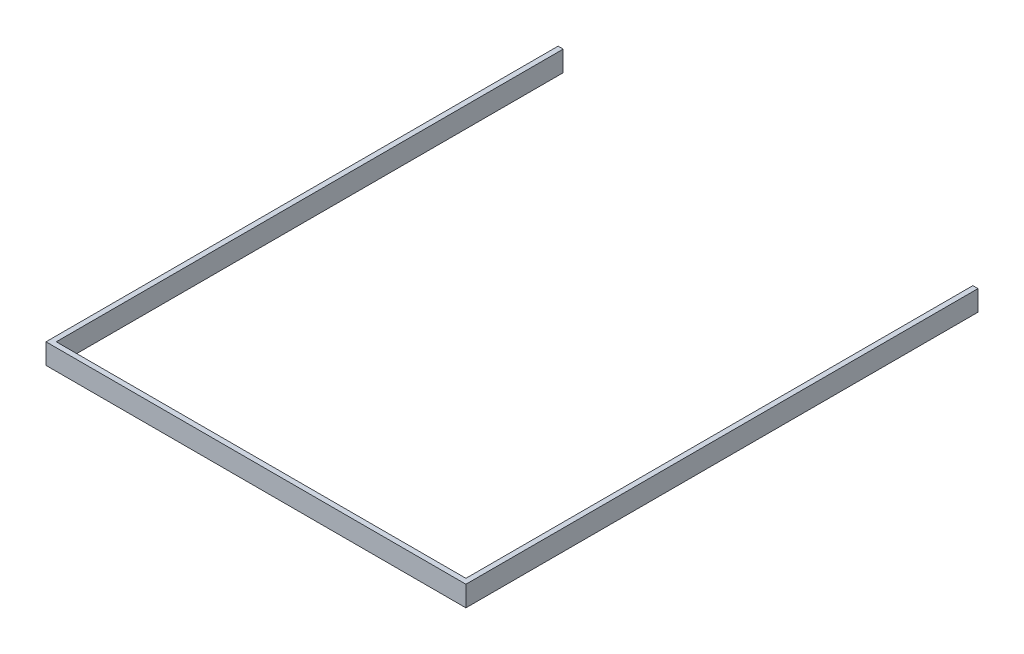
ISO-10303-21;
HEADER;
FILE_DESCRIPTION(('STEP AP214'),'2;1');
FILE_NAME('part.step','',(''),(''),'','','');
FILE_SCHEMA(('AUTOMOTIVE_DESIGN { 1 0 10303 214 1 1 1 1 }'));
ENDSEC;
DATA;
#1=APPLICATION_CONTEXT('core data for automotive mechanical design processes');
#2=APPLICATION_PROTOCOL_DEFINITION('international standard','automotive_design',2000,#1);
#3=PRODUCT_CONTEXT('',#1,'mechanical');
#4=PRODUCT('Part','Part','',(#3));
#5=PRODUCT_RELATED_PRODUCT_CATEGORY('part','',(#4));
#6=PRODUCT_DEFINITION_FORMATION('','',#4);
#7=PRODUCT_DEFINITION_CONTEXT('part definition',#1,'design');
#8=PRODUCT_DEFINITION('design','',#6,#7);
#9=PRODUCT_DEFINITION_SHAPE('','',#8);
#10=(LENGTH_UNIT() NAMED_UNIT(*) SI_UNIT(.MILLI.,.METRE.));
#11=(NAMED_UNIT(*) PLANE_ANGLE_UNIT() SI_UNIT($,.RADIAN.));
#12=(NAMED_UNIT(*) SI_UNIT($,.STERADIAN.) SOLID_ANGLE_UNIT());
#13=UNCERTAINTY_MEASURE_WITH_UNIT(LENGTH_MEASURE(1.E-05),#10,'distance_accuracy_value','');
#14=(GEOMETRIC_REPRESENTATION_CONTEXT(3) GLOBAL_UNCERTAINTY_ASSIGNED_CONTEXT((#13)) GLOBAL_UNIT_ASSIGNED_CONTEXT((#10,
#11,#12)) REPRESENTATION_CONTEXT('',''));
#15=CARTESIAN_POINT('',(0.,0.,0.));
#16=DIRECTION('',(0.,0.,1.));
#17=DIRECTION('',(1.,0.,0.));
#18=AXIS2_PLACEMENT_3D('',#15,#16,#17);
#19=CARTESIAN_POINT('',(0.,-8.,200.));
#20=DIRECTION('',(0.,1.,0.));
#21=DIRECTION('',(0.,0.,1.));
#22=AXIS2_PLACEMENT_3D('',#19,#20,#21);
#23=PLANE('',#22);
#24=DIRECTION('',(0.,0.,-1.));
#25=VECTOR('',#24,1.);
#26=CARTESIAN_POINT('',(2.,-8.,198.));
#27=LINE('',#26,#25);
#28=CARTESIAN_POINT('',(2.,-8.,198.));
#29=VERTEX_POINT('',#28);
#30=CARTESIAN_POINT('',(2.,-8.,0.));
#31=VERTEX_POINT('',#30);
#32=EDGE_CURVE('E124',#29,#31,#27,.T.);
#33=ORIENTED_EDGE('',*,*,#32,.F.);
#34=DIRECTION('',(1.,0.,0.));
#35=VECTOR('',#34,1.);
#36=CARTESIAN_POINT('',(2.,-8.,198.));
#37=LINE('',#36,#35);
#38=CARTESIAN_POINT('',(162.,-8.,198.));
#39=VERTEX_POINT('',#38);
#40=EDGE_CURVE('E112',#29,#39,#37,.T.);
#41=ORIENTED_EDGE('',*,*,#40,.T.);
#42=DIRECTION('',(0.,0.,-1.));
#43=VECTOR('',#42,1.);
#44=CARTESIAN_POINT('',(162.,-8.,198.));
#45=LINE('',#44,#43);
#46=CARTESIAN_POINT('',(162.,-8.,0.));
#47=VERTEX_POINT('',#46);
#48=EDGE_CURVE('E132',#39,#47,#45,.T.);
#49=ORIENTED_EDGE('',*,*,#48,.T.);
#50=DIRECTION('',(1.,0.,0.));
#51=VECTOR('',#50,1.);
#52=CARTESIAN_POINT('',(0.,-8.,0.));
#53=LINE('',#52,#51);
#54=CARTESIAN_POINT('',(164.,-8.,0.));
#55=VERTEX_POINT('',#54);
#56=EDGE_CURVE('E135',#47,#55,#53,.T.);
#57=ORIENTED_EDGE('',*,*,#56,.T.);
#58=DIRECTION('',(0.,0.,-1.));
#59=VECTOR('',#58,1.);
#60=CARTESIAN_POINT('',(164.,-8.,200.));
#61=LINE('',#60,#59);
#62=CARTESIAN_POINT('',(164.,-8.,200.));
#63=VERTEX_POINT('',#62);
#64=EDGE_CURVE('E45',#63,#55,#61,.T.);
#65=ORIENTED_EDGE('',*,*,#64,.F.);
#66=DIRECTION('',(1.,0.,0.));
#67=VECTOR('',#66,1.);
#68=CARTESIAN_POINT('',(0.,-8.,200.));
#69=LINE('',#68,#67);
#70=CARTESIAN_POINT('',(0.,-8.,200.));
#71=VERTEX_POINT('',#70);
#72=EDGE_CURVE('E89',#71,#63,#69,.T.);
#73=ORIENTED_EDGE('',*,*,#72,.F.);
#74=DIRECTION('',(0.,0.,-1.));
#75=VECTOR('',#74,1.);
#76=CARTESIAN_POINT('',(0.,-8.,200.));
#77=LINE('',#76,#75);
#78=CARTESIAN_POINT('',(0.,-8.,0.));
#79=VERTEX_POINT('',#78);
#80=EDGE_CURVE('E11',#71,#79,#77,.T.);
#81=ORIENTED_EDGE('',*,*,#80,.T.);
#82=EDGE_CURVE('E130',#79,#31,#53,.T.);
#83=ORIENTED_EDGE('',*,*,#82,.T.);
#84=EDGE_LOOP('',(#33,#41,#49,#57,#65,#73,#81,#83));
#85=FACE_BOUND('',#84,.T.);
#86=ADVANCED_FACE('F37',(#85),#23,.F.);
#87=CARTESIAN_POINT('',(0.,0.,200.));
#88=DIRECTION('',(0.,-1.,0.));
#89=DIRECTION('',(0.,0.,-1.));
#90=AXIS2_PLACEMENT_3D('',#87,#88,#89);
#91=PLANE('',#90);
#92=DIRECTION('',(0.,0.,-1.));
#93=VECTOR('',#92,1.);
#94=CARTESIAN_POINT('',(2.,0.,198.));
#95=LINE('',#94,#93);
#96=CARTESIAN_POINT('',(2.,0.,198.));
#97=VERTEX_POINT('',#96);
#98=CARTESIAN_POINT('',(2.,0.,0.));
#99=VERTEX_POINT('',#98);
#100=EDGE_CURVE('E126',#97,#99,#95,.T.);
#101=ORIENTED_EDGE('',*,*,#100,.T.);
#102=DIRECTION('',(-1.,0.,0.));
#103=VECTOR('',#102,1.);
#104=CARTESIAN_POINT('',(0.,0.,0.));
#105=LINE('',#104,#103);
#106=CARTESIAN_POINT('',(0.,0.,0.));
#107=VERTEX_POINT('',#106);
#108=EDGE_CURVE('E82',#99,#107,#105,.T.);
#109=ORIENTED_EDGE('',*,*,#108,.T.);
#110=DIRECTION('',(0.,0.,-1.));
#111=VECTOR('',#110,1.);
#112=CARTESIAN_POINT('',(0.,0.,200.));
#113=LINE('',#112,#111);
#114=CARTESIAN_POINT('',(0.,0.,200.));
#115=VERTEX_POINT('',#114);
#116=EDGE_CURVE('E146',#115,#107,#113,.T.);
#117=ORIENTED_EDGE('',*,*,#116,.F.);
#118=DIRECTION('',(-1.,0.,0.));
#119=VECTOR('',#118,1.);
#120=CARTESIAN_POINT('',(0.,0.,200.));
#121=LINE('',#120,#119);
#122=CARTESIAN_POINT('',(164.,0.,200.));
#123=VERTEX_POINT('',#122);
#124=EDGE_CURVE('E61',#123,#115,#121,.T.);
#125=ORIENTED_EDGE('',*,*,#124,.F.);
#126=DIRECTION('',(0.,0.,-1.));
#127=VECTOR('',#126,1.);
#128=CARTESIAN_POINT('',(164.,0.,200.));
#129=LINE('',#128,#127);
#130=CARTESIAN_POINT('',(164.,0.,0.));
#131=VERTEX_POINT('',#130);
#132=EDGE_CURVE('E154',#123,#131,#129,.T.);
#133=ORIENTED_EDGE('',*,*,#132,.T.);
#134=CARTESIAN_POINT('',(162.,0.,0.));
#135=VERTEX_POINT('',#134);
#136=EDGE_CURVE('E142',#131,#135,#105,.T.);
#137=ORIENTED_EDGE('',*,*,#136,.T.);
#138=DIRECTION('',(0.,0.,-1.));
#139=VECTOR('',#138,1.);
#140=CARTESIAN_POINT('',(162.,0.,198.));
#141=LINE('',#140,#139);
#142=CARTESIAN_POINT('',(162.,0.,198.));
#143=VERTEX_POINT('',#142);
#144=EDGE_CURVE('E52',#143,#135,#141,.T.);
#145=ORIENTED_EDGE('',*,*,#144,.F.);
#146=DIRECTION('',(-1.,0.,0.));
#147=VECTOR('',#146,1.);
#148=CARTESIAN_POINT('',(2.,0.,198.));
#149=LINE('',#148,#147);
#150=EDGE_CURVE('E197',#143,#97,#149,.T.);
#151=ORIENTED_EDGE('',*,*,#150,.T.);
#152=EDGE_LOOP('',(#101,#109,#117,#125,#133,#137,#145,#151));
#153=FACE_BOUND('',#152,.T.);
#154=ADVANCED_FACE('F166',(#153),#91,.F.);
#155=CARTESIAN_POINT('',(0.,0.,0.));
#156=DIRECTION('',(0.,0.,1.));
#157=DIRECTION('',(1.,0.,0.));
#158=AXIS2_PLACEMENT_3D('',#155,#156,#157);
#159=PLANE('',#158);
#160=DIRECTION('',(0.,-1.,0.));
#161=VECTOR('',#160,1.);
#162=CARTESIAN_POINT('',(2.,0.,0.));
#163=LINE('',#162,#161);
#164=EDGE_CURVE('E193',#99,#31,#163,.T.);
#165=ORIENTED_EDGE('',*,*,#164,.T.);
#166=ORIENTED_EDGE('',*,*,#82,.F.);
#167=DIRECTION('',(0.,-1.,0.));
#168=VECTOR('',#167,1.);
#169=CARTESIAN_POINT('',(0.,0.,0.));
#170=LINE('',#169,#168);
#171=EDGE_CURVE('E131',#107,#79,#170,.T.);
#172=ORIENTED_EDGE('',*,*,#171,.F.);
#173=ORIENTED_EDGE('',*,*,#108,.F.);
#174=EDGE_LOOP('',(#165,#166,#172,#173));
#175=FACE_BOUND('',#174,.T.);
#176=ADVANCED_FACE('F186',(#175),#159,.F.);
#177=DIRECTION('',(0.,1.,0.));
#178=VECTOR('',#177,1.);
#179=CARTESIAN_POINT('',(162.,0.,0.));
#180=LINE('',#179,#178);
#181=EDGE_CURVE('E127',#47,#135,#180,.T.);
#182=ORIENTED_EDGE('',*,*,#181,.T.);
#183=ORIENTED_EDGE('',*,*,#136,.F.);
#184=DIRECTION('',(0.,1.,0.));
#185=VECTOR('',#184,1.);
#186=CARTESIAN_POINT('',(164.,0.,0.));
#187=LINE('',#186,#185);
#188=EDGE_CURVE('E149',#55,#131,#187,.T.);
#189=ORIENTED_EDGE('',*,*,#188,.F.);
#190=ORIENTED_EDGE('',*,*,#56,.F.);
#191=EDGE_LOOP('',(#182,#183,#189,#190));
#192=FACE_BOUND('',#191,.T.);
#193=ADVANCED_FACE('F165',(#192),#159,.F.);
#194=CARTESIAN_POINT('',(0.,0.,200.));
#195=DIRECTION('',(1.,0.,0.));
#196=DIRECTION('',(0.,1.,0.));
#197=AXIS2_PLACEMENT_3D('',#194,#195,#196);
#198=PLANE('',#197);
#199=ORIENTED_EDGE('',*,*,#171,.T.);
#200=ORIENTED_EDGE('',*,*,#80,.F.);
#201=DIRECTION('',(0.,-1.,0.));
#202=VECTOR('',#201,1.);
#203=CARTESIAN_POINT('',(0.,0.,200.));
#204=LINE('',#203,#202);
#205=EDGE_CURVE('E140',#115,#71,#204,.T.);
#206=ORIENTED_EDGE('',*,*,#205,.F.);
#207=ORIENTED_EDGE('',*,*,#116,.T.);
#208=EDGE_LOOP('',(#199,#200,#206,#207));
#209=FACE_BOUND('',#208,.T.);
#210=ADVANCED_FACE('F39',(#209),#198,.F.);
#211=CARTESIAN_POINT('',(164.,0.,200.));
#212=DIRECTION('',(-1.,0.,0.));
#213=DIRECTION('',(0.,0.,1.));
#214=AXIS2_PLACEMENT_3D('',#211,#212,#213);
#215=PLANE('',#214);
#216=ORIENTED_EDGE('',*,*,#188,.T.);
#217=ORIENTED_EDGE('',*,*,#132,.F.);
#218=DIRECTION('',(0.,1.,0.));
#219=VECTOR('',#218,1.);
#220=CARTESIAN_POINT('',(164.,0.,200.));
#221=LINE('',#220,#219);
#222=EDGE_CURVE('E144',#63,#123,#221,.T.);
#223=ORIENTED_EDGE('',*,*,#222,.F.);
#224=ORIENTED_EDGE('',*,*,#64,.T.);
#225=EDGE_LOOP('',(#216,#217,#223,#224));
#226=FACE_BOUND('',#225,.T.);
#227=ADVANCED_FACE('F160',(#226),#215,.F.);
#228=CARTESIAN_POINT('',(0.,0.,200.));
#229=DIRECTION('',(0.,0.,1.));
#230=DIRECTION('',(1.,0.,0.));
#231=AXIS2_PLACEMENT_3D('',#228,#229,#230);
#232=PLANE('',#231);
#233=ORIENTED_EDGE('',*,*,#205,.T.);
#234=ORIENTED_EDGE('',*,*,#72,.T.);
#235=ORIENTED_EDGE('',*,*,#222,.T.);
#236=ORIENTED_EDGE('',*,*,#124,.T.);
#237=EDGE_LOOP('',(#233,#234,#235,#236));
#238=FACE_BOUND('',#237,.T.);
#239=ADVANCED_FACE('F171',(#238),#232,.T.);
#240=CARTESIAN_POINT('',(2.,0.,198.));
#241=DIRECTION('',(1.,0.,0.));
#242=DIRECTION('',(0.,1.,0.));
#243=AXIS2_PLACEMENT_3D('',#240,#241,#242);
#244=PLANE('',#243);
#245=ORIENTED_EDGE('',*,*,#164,.F.);
#246=ORIENTED_EDGE('',*,*,#100,.F.);
#247=DIRECTION('',(0.,-1.,0.));
#248=VECTOR('',#247,1.);
#249=CARTESIAN_POINT('',(2.,0.,198.));
#250=LINE('',#249,#248);
#251=EDGE_CURVE('E116',#97,#29,#250,.T.);
#252=ORIENTED_EDGE('',*,*,#251,.T.);
#253=ORIENTED_EDGE('',*,*,#32,.T.);
#254=EDGE_LOOP('',(#245,#246,#252,#253));
#255=FACE_BOUND('',#254,.T.);
#256=ADVANCED_FACE('F123',(#255),#244,.T.);
#257=CARTESIAN_POINT('',(162.,0.,198.));
#258=DIRECTION('',(-1.,0.,0.));
#259=DIRECTION('',(0.,0.,1.));
#260=AXIS2_PLACEMENT_3D('',#257,#258,#259);
#261=PLANE('',#260);
#262=ORIENTED_EDGE('',*,*,#181,.F.);
#263=ORIENTED_EDGE('',*,*,#48,.F.);
#264=DIRECTION('',(0.,1.,0.));
#265=VECTOR('',#264,1.);
#266=CARTESIAN_POINT('',(162.,0.,198.));
#267=LINE('',#266,#265);
#268=EDGE_CURVE('E118',#39,#143,#267,.T.);
#269=ORIENTED_EDGE('',*,*,#268,.T.);
#270=ORIENTED_EDGE('',*,*,#144,.T.);
#271=EDGE_LOOP('',(#262,#263,#269,#270));
#272=FACE_BOUND('',#271,.T.);
#273=ADVANCED_FACE('F178',(#272),#261,.T.);
#274=CARTESIAN_POINT('',(0.,0.,198.));
#275=DIRECTION('',(0.,0.,1.));
#276=DIRECTION('',(1.,0.,0.));
#277=AXIS2_PLACEMENT_3D('',#274,#275,#276);
#278=PLANE('',#277);
#279=ORIENTED_EDGE('',*,*,#251,.F.);
#280=ORIENTED_EDGE('',*,*,#150,.F.);
#281=ORIENTED_EDGE('',*,*,#268,.F.);
#282=ORIENTED_EDGE('',*,*,#40,.F.);
#283=EDGE_LOOP('',(#279,#280,#281,#282));
#284=FACE_BOUND('',#283,.T.);
#285=ADVANCED_FACE('F114',(#284),#278,.F.);
#286=CLOSED_SHELL('',(#86,#154,#176,#193,#210,#227,#239,#256,#273,#285));
#287=MANIFOLD_SOLID_BREP('B2',#286);
#288=ADVANCED_BREP_SHAPE_REPRESENTATION('',(#18,#287),#14);
#289=SHAPE_DEFINITION_REPRESENTATION(#9,#288);
ENDSEC;
END-ISO-10303-21;
